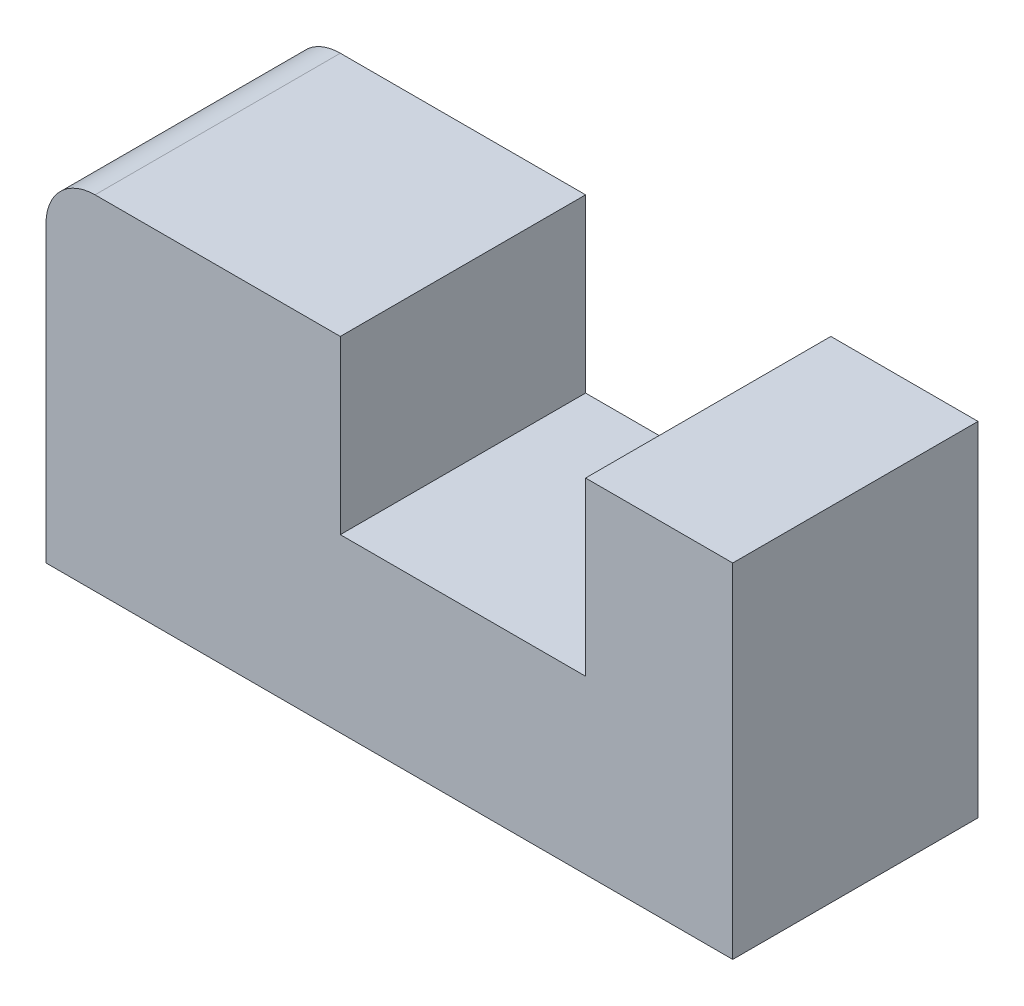
ISO-10303-21;
HEADER;
FILE_DESCRIPTION(('STEP AP214'),'2;1');
FILE_NAME('part.step','',(''),(''),'','','');
FILE_SCHEMA(('AUTOMOTIVE_DESIGN { 1 0 10303 214 1 1 1 1 }'));
ENDSEC;
DATA;
#1=APPLICATION_CONTEXT('core data for automotive mechanical design processes');
#2=APPLICATION_PROTOCOL_DEFINITION('international standard','automotive_design',2000,#1);
#3=PRODUCT_CONTEXT('',#1,'mechanical');
#4=PRODUCT('Part','Part','',(#3));
#5=PRODUCT_RELATED_PRODUCT_CATEGORY('part','',(#4));
#6=PRODUCT_DEFINITION_FORMATION('','',#4);
#7=PRODUCT_DEFINITION_CONTEXT('part definition',#1,'design');
#8=PRODUCT_DEFINITION('design','',#6,#7);
#9=PRODUCT_DEFINITION_SHAPE('','',#8);
#10=(LENGTH_UNIT() NAMED_UNIT(*) SI_UNIT(.MILLI.,.METRE.));
#11=(NAMED_UNIT(*) PLANE_ANGLE_UNIT() SI_UNIT($,.RADIAN.));
#12=(NAMED_UNIT(*) SI_UNIT($,.STERADIAN.) SOLID_ANGLE_UNIT());
#13=UNCERTAINTY_MEASURE_WITH_UNIT(LENGTH_MEASURE(1.E-05),#10,'distance_accuracy_value','');
#14=(GEOMETRIC_REPRESENTATION_CONTEXT(3) GLOBAL_UNCERTAINTY_ASSIGNED_CONTEXT((#13)) GLOBAL_UNIT_ASSIGNED_CONTEXT((#10,
#11,#12)) REPRESENTATION_CONTEXT('',''));
#15=CARTESIAN_POINT('',(0.,0.,0.));
#16=DIRECTION('',(0.,0.,1.));
#17=DIRECTION('',(1.,0.,0.));
#18=AXIS2_PLACEMENT_3D('',#15,#16,#17);
#19=CARTESIAN_POINT('',(-70.,-35.,50.));
#20=DIRECTION('',(1.,0.,0.));
#21=DIRECTION('',(0.,0.,-1.));
#22=AXIS2_PLACEMENT_3D('',#19,#20,#21);
#23=PLANE('',#22);
#24=DIRECTION('',(0.,-1.,0.));
#25=VECTOR('',#24,1.);
#26=CARTESIAN_POINT('',(-70.,-35.,50.));
#27=LINE('',#26,#25);
#28=CARTESIAN_POINT('',(-70.,25.,50.));
#29=VERTEX_POINT('',#28);
#30=CARTESIAN_POINT('',(-70.,-35.,50.));
#31=VERTEX_POINT('',#30);
#32=EDGE_CURVE('E105',#29,#31,#27,.T.);
#33=ORIENTED_EDGE('',*,*,#32,.F.);
#34=DIRECTION('',(0.,0.,-1.));
#35=VECTOR('',#34,1.);
#36=CARTESIAN_POINT('',(-70.,25.,50.));
#37=LINE('',#36,#35);
#38=CARTESIAN_POINT('',(-70.,25.,0.));
#39=VERTEX_POINT('',#38);
#40=EDGE_CURVE('E128',#29,#39,#37,.T.);
#41=ORIENTED_EDGE('',*,*,#40,.T.);
#42=DIRECTION('',(0.,-1.,0.));
#43=VECTOR('',#42,1.);
#44=CARTESIAN_POINT('',(-70.,-35.,0.));
#45=LINE('',#44,#43);
#46=CARTESIAN_POINT('',(-70.,-35.,0.));
#47=VERTEX_POINT('',#46);
#48=EDGE_CURVE('E126',#39,#47,#45,.T.);
#49=ORIENTED_EDGE('',*,*,#48,.T.);
#50=DIRECTION('',(0.,0.,-1.));
#51=VECTOR('',#50,1.);
#52=CARTESIAN_POINT('',(-70.,-35.,50.));
#53=LINE('',#52,#51);
#54=EDGE_CURVE('E120',#31,#47,#53,.T.);
#55=ORIENTED_EDGE('',*,*,#54,.F.);
#56=EDGE_LOOP('',(#33,#41,#49,#55));
#57=FACE_BOUND('',#56,.T.);
#58=ADVANCED_FACE('F35',(#57),#23,.F.);
#59=CARTESIAN_POINT('',(70.,-35.,50.));
#60=DIRECTION('',(0.,1.,0.));
#61=DIRECTION('',(-1.,0.,0.));
#62=AXIS2_PLACEMENT_3D('',#59,#60,#61);
#63=PLANE('',#62);
#64=DIRECTION('',(1.,0.,0.));
#65=VECTOR('',#64,1.);
#66=CARTESIAN_POINT('',(70.,-35.,0.));
#67=LINE('',#66,#65);
#68=CARTESIAN_POINT('',(70.,-35.,0.));
#69=VERTEX_POINT('',#68);
#70=EDGE_CURVE('E161',#47,#69,#67,.T.);
#71=ORIENTED_EDGE('',*,*,#70,.T.);
#72=DIRECTION('',(0.,0.,-1.));
#73=VECTOR('',#72,1.);
#74=CARTESIAN_POINT('',(70.,-35.,50.));
#75=LINE('',#74,#73);
#76=CARTESIAN_POINT('',(70.,-35.,50.));
#77=VERTEX_POINT('',#76);
#78=EDGE_CURVE('E122',#77,#69,#75,.T.);
#79=ORIENTED_EDGE('',*,*,#78,.F.);
#80=DIRECTION('',(1.,0.,0.));
#81=VECTOR('',#80,1.);
#82=CARTESIAN_POINT('',(70.,-35.,50.));
#83=LINE('',#82,#81);
#84=EDGE_CURVE('E108',#31,#77,#83,.T.);
#85=ORIENTED_EDGE('',*,*,#84,.F.);
#86=ORIENTED_EDGE('',*,*,#54,.T.);
#87=EDGE_LOOP('',(#71,#79,#85,#86));
#88=FACE_BOUND('',#87,.T.);
#89=ADVANCED_FACE('F119',(#88),#63,.F.);
#90=CARTESIAN_POINT('',(70.,-35.,50.));
#91=DIRECTION('',(-1.,0.,0.));
#92=DIRECTION('',(0.,0.,1.));
#93=AXIS2_PLACEMENT_3D('',#90,#91,#92);
#94=PLANE('',#93);
#95=DIRECTION('',(0.,1.,0.));
#96=VECTOR('',#95,1.);
#97=CARTESIAN_POINT('',(70.,-35.,0.));
#98=LINE('',#97,#96);
#99=CARTESIAN_POINT('',(70.,35.,0.));
#100=VERTEX_POINT('',#99);
#101=EDGE_CURVE('E159',#69,#100,#98,.T.);
#102=ORIENTED_EDGE('',*,*,#101,.T.);
#103=DIRECTION('',(0.,0.,-1.));
#104=VECTOR('',#103,1.);
#105=CARTESIAN_POINT('',(70.,35.,50.));
#106=LINE('',#105,#104);
#107=CARTESIAN_POINT('',(70.,35.,50.));
#108=VERTEX_POINT('',#107);
#109=EDGE_CURVE('E131',#108,#100,#106,.T.);
#110=ORIENTED_EDGE('',*,*,#109,.F.);
#111=DIRECTION('',(0.,1.,0.));
#112=VECTOR('',#111,1.);
#113=CARTESIAN_POINT('',(70.,-35.,50.));
#114=LINE('',#113,#112);
#115=EDGE_CURVE('E124',#77,#108,#114,.T.);
#116=ORIENTED_EDGE('',*,*,#115,.F.);
#117=ORIENTED_EDGE('',*,*,#78,.T.);
#118=EDGE_LOOP('',(#102,#110,#116,#117));
#119=FACE_BOUND('',#118,.T.);
#120=ADVANCED_FACE('F177',(#119),#94,.F.);
#121=CARTESIAN_POINT('',(70.,35.,50.));
#122=DIRECTION('',(0.,-1.,0.));
#123=DIRECTION('',(1.,0.,0.));
#124=AXIS2_PLACEMENT_3D('',#121,#122,#123);
#125=PLANE('',#124);
#126=DIRECTION('',(-1.,0.,0.));
#127=VECTOR('',#126,1.);
#128=CARTESIAN_POINT('',(70.,35.,0.));
#129=LINE('',#128,#127);
#130=CARTESIAN_POINT('',(40.,35.,0.));
#131=VERTEX_POINT('',#130);
#132=EDGE_CURVE('E157',#100,#131,#129,.T.);
#133=ORIENTED_EDGE('',*,*,#132,.T.);
#134=DIRECTION('',(0.,0.,-1.));
#135=VECTOR('',#134,1.);
#136=CARTESIAN_POINT('',(40.,35.,50.));
#137=LINE('',#136,#135);
#138=CARTESIAN_POINT('',(40.,35.,50.));
#139=VERTEX_POINT('',#138);
#140=EDGE_CURVE('E137',#139,#131,#137,.T.);
#141=ORIENTED_EDGE('',*,*,#140,.F.);
#142=DIRECTION('',(-1.,0.,0.));
#143=VECTOR('',#142,1.);
#144=CARTESIAN_POINT('',(70.,35.,50.));
#145=LINE('',#144,#143);
#146=EDGE_CURVE('E171',#108,#139,#145,.T.);
#147=ORIENTED_EDGE('',*,*,#146,.F.);
#148=ORIENTED_EDGE('',*,*,#109,.T.);
#149=EDGE_LOOP('',(#133,#141,#147,#148));
#150=FACE_BOUND('',#149,.T.);
#151=ADVANCED_FACE('F181',(#150),#125,.F.);
#152=CARTESIAN_POINT('',(40.,35.,50.));
#153=DIRECTION('',(1.,0.,0.));
#154=DIRECTION('',(0.,0.,-1.));
#155=AXIS2_PLACEMENT_3D('',#152,#153,#154);
#156=PLANE('',#155);
#157=DIRECTION('',(0.,-1.,0.));
#158=VECTOR('',#157,1.);
#159=CARTESIAN_POINT('',(40.,35.,0.));
#160=LINE('',#159,#158);
#161=CARTESIAN_POINT('',(40.,0.,0.));
#162=VERTEX_POINT('',#161);
#163=EDGE_CURVE('E155',#131,#162,#160,.T.);
#164=ORIENTED_EDGE('',*,*,#163,.T.);
#165=DIRECTION('',(0.,0.,-1.));
#166=VECTOR('',#165,1.);
#167=CARTESIAN_POINT('',(40.,0.,50.));
#168=LINE('',#167,#166);
#169=CARTESIAN_POINT('',(40.,0.,50.));
#170=VERTEX_POINT('',#169);
#171=EDGE_CURVE('E140',#170,#162,#168,.T.);
#172=ORIENTED_EDGE('',*,*,#171,.F.);
#173=DIRECTION('',(0.,-1.,0.));
#174=VECTOR('',#173,1.);
#175=CARTESIAN_POINT('',(40.,35.,50.));
#176=LINE('',#175,#174);
#177=EDGE_CURVE('E169',#139,#170,#176,.T.);
#178=ORIENTED_EDGE('',*,*,#177,.F.);
#179=ORIENTED_EDGE('',*,*,#140,.T.);
#180=EDGE_LOOP('',(#164,#172,#178,#179));
#181=FACE_BOUND('',#180,.T.);
#182=ADVANCED_FACE('F186',(#181),#156,.F.);
#183=CARTESIAN_POINT('',(40.,0.,50.));
#184=DIRECTION('',(0.,-1.,0.));
#185=DIRECTION('',(1.,0.,0.));
#186=AXIS2_PLACEMENT_3D('',#183,#184,#185);
#187=PLANE('',#186);
#188=DIRECTION('',(-1.,0.,0.));
#189=VECTOR('',#188,1.);
#190=CARTESIAN_POINT('',(40.,0.,0.));
#191=LINE('',#190,#189);
#192=CARTESIAN_POINT('',(-9.99999999999998,0.,0.));
#193=VERTEX_POINT('',#192);
#194=EDGE_CURVE('E153',#162,#193,#191,.T.);
#195=ORIENTED_EDGE('',*,*,#194,.T.);
#196=DIRECTION('',(0.,0.,-1.));
#197=VECTOR('',#196,1.);
#198=CARTESIAN_POINT('',(-9.99999999999998,0.,50.));
#199=LINE('',#198,#197);
#200=CARTESIAN_POINT('',(-9.99999999999998,0.,50.));
#201=VERTEX_POINT('',#200);
#202=EDGE_CURVE('E143',#201,#193,#199,.T.);
#203=ORIENTED_EDGE('',*,*,#202,.F.);
#204=DIRECTION('',(-1.,0.,0.));
#205=VECTOR('',#204,1.);
#206=CARTESIAN_POINT('',(40.,0.,50.));
#207=LINE('',#206,#205);
#208=EDGE_CURVE('E167',#170,#201,#207,.T.);
#209=ORIENTED_EDGE('',*,*,#208,.F.);
#210=ORIENTED_EDGE('',*,*,#171,.T.);
#211=EDGE_LOOP('',(#195,#203,#209,#210));
#212=FACE_BOUND('',#211,.T.);
#213=ADVANCED_FACE('F192',(#212),#187,.F.);
#214=CARTESIAN_POINT('',(-9.99999999999998,35.,50.));
#215=DIRECTION('',(-1.,0.,0.));
#216=DIRECTION('',(0.,-1.,0.));
#217=AXIS2_PLACEMENT_3D('',#214,#215,#216);
#218=PLANE('',#217);
#219=DIRECTION('',(0.,1.,0.));
#220=VECTOR('',#219,1.);
#221=CARTESIAN_POINT('',(-9.99999999999998,35.,0.));
#222=LINE('',#221,#220);
#223=CARTESIAN_POINT('',(-9.99999999999998,35.,0.));
#224=VERTEX_POINT('',#223);
#225=EDGE_CURVE('E151',#193,#224,#222,.T.);
#226=ORIENTED_EDGE('',*,*,#225,.T.);
#227=DIRECTION('',(0.,0.,-1.));
#228=VECTOR('',#227,1.);
#229=CARTESIAN_POINT('',(-9.99999999999998,35.,50.));
#230=LINE('',#229,#228);
#231=CARTESIAN_POINT('',(-9.99999999999998,35.,50.));
#232=VERTEX_POINT('',#231);
#233=EDGE_CURVE('E146',#232,#224,#230,.T.);
#234=ORIENTED_EDGE('',*,*,#233,.F.);
#235=DIRECTION('',(0.,1.,0.));
#236=VECTOR('',#235,1.);
#237=CARTESIAN_POINT('',(-9.99999999999998,35.,50.));
#238=LINE('',#237,#236);
#239=EDGE_CURVE('E165',#201,#232,#238,.T.);
#240=ORIENTED_EDGE('',*,*,#239,.F.);
#241=ORIENTED_EDGE('',*,*,#202,.T.);
#242=EDGE_LOOP('',(#226,#234,#240,#241));
#243=FACE_BOUND('',#242,.T.);
#244=ADVANCED_FACE('F196',(#243),#218,.F.);
#245=CARTESIAN_POINT('',(-9.99999999999998,35.,50.));
#246=DIRECTION('',(0.,-1.,0.));
#247=DIRECTION('',(0.,0.,-1.));
#248=AXIS2_PLACEMENT_3D('',#245,#246,#247);
#249=PLANE('',#248);
#250=DIRECTION('',(-1.,0.,0.));
#251=VECTOR('',#250,1.);
#252=CARTESIAN_POINT('',(-9.99999999999998,35.,0.));
#253=LINE('',#252,#251);
#254=CARTESIAN_POINT('',(-60.,35.,0.));
#255=VERTEX_POINT('',#254);
#256=EDGE_CURVE('E115',#224,#255,#253,.T.);
#257=ORIENTED_EDGE('',*,*,#256,.T.);
#258=DIRECTION('',(0.,0.,-1.));
#259=VECTOR('',#258,1.);
#260=CARTESIAN_POINT('',(-60.,35.,50.));
#261=LINE('',#260,#259);
#262=CARTESIAN_POINT('',(-60.,35.,50.));
#263=VERTEX_POINT('',#262);
#264=EDGE_CURVE('E43',#255,#263,#261,.F.);
#265=ORIENTED_EDGE('',*,*,#264,.T.);
#266=DIRECTION('',(-1.,0.,0.));
#267=VECTOR('',#266,1.);
#268=CARTESIAN_POINT('',(-9.99999999999998,35.,50.));
#269=LINE('',#268,#267);
#270=EDGE_CURVE('E149',#232,#263,#269,.T.);
#271=ORIENTED_EDGE('',*,*,#270,.F.);
#272=ORIENTED_EDGE('',*,*,#233,.T.);
#273=EDGE_LOOP('',(#257,#265,#271,#272));
#274=FACE_BOUND('',#273,.T.);
#275=ADVANCED_FACE('F197',(#274),#249,.F.);
#276=CARTESIAN_POINT('',(0.,0.,50.));
#277=DIRECTION('',(0.,0.,1.));
#278=DIRECTION('',(1.,0.,0.));
#279=AXIS2_PLACEMENT_3D('',#276,#277,#278);
#280=PLANE('',#279);
#281=ORIENTED_EDGE('',*,*,#270,.T.);
#282=CARTESIAN_POINT('',(-60.,25.,50.));
#283=DIRECTION('',(0.,0.,1.));
#284=DIRECTION('',(1.,0.,0.));
#285=AXIS2_PLACEMENT_3D('',#282,#283,#284);
#286=CIRCLE('',#285,10.);
#287=EDGE_CURVE('E11',#263,#29,#286,.T.);
#288=ORIENTED_EDGE('',*,*,#287,.T.);
#289=ORIENTED_EDGE('',*,*,#32,.T.);
#290=ORIENTED_EDGE('',*,*,#84,.T.);
#291=ORIENTED_EDGE('',*,*,#115,.T.);
#292=ORIENTED_EDGE('',*,*,#146,.T.);
#293=ORIENTED_EDGE('',*,*,#177,.T.);
#294=ORIENTED_EDGE('',*,*,#208,.T.);
#295=ORIENTED_EDGE('',*,*,#239,.T.);
#296=EDGE_LOOP('',(#281,#288,#289,#290,#291,#292,#293,#294,#295));
#297=FACE_BOUND('',#296,.T.);
#298=ADVANCED_FACE('F107',(#297),#280,.T.);
#299=CARTESIAN_POINT('',(0.,0.,0.));
#300=DIRECTION('',(0.,0.,1.));
#301=DIRECTION('',(1.,0.,0.));
#302=AXIS2_PLACEMENT_3D('',#299,#300,#301);
#303=PLANE('',#302);
#304=ORIENTED_EDGE('',*,*,#48,.F.);
#305=CARTESIAN_POINT('',(-60.,25.,0.));
#306=DIRECTION('',(0.,0.,1.));
#307=DIRECTION('',(1.,0.,0.));
#308=AXIS2_PLACEMENT_3D('',#305,#306,#307);
#309=CIRCLE('',#308,10.);
#310=EDGE_CURVE('E57',#39,#255,#309,.F.);
#311=ORIENTED_EDGE('',*,*,#310,.T.);
#312=ORIENTED_EDGE('',*,*,#256,.F.);
#313=ORIENTED_EDGE('',*,*,#225,.F.);
#314=ORIENTED_EDGE('',*,*,#194,.F.);
#315=ORIENTED_EDGE('',*,*,#163,.F.);
#316=ORIENTED_EDGE('',*,*,#132,.F.);
#317=ORIENTED_EDGE('',*,*,#101,.F.);
#318=ORIENTED_EDGE('',*,*,#70,.F.);
#319=EDGE_LOOP('',(#304,#311,#312,#313,#314,#315,#316,#317,#318));
#320=FACE_BOUND('',#319,.T.);
#321=ADVANCED_FACE('F199',(#320),#303,.F.);
#322=CARTESIAN_POINT('',(-60.,25.,50.));
#323=DIRECTION('',(0.,0.,-1.));
#324=DIRECTION('',(-1.,0.,0.));
#325=AXIS2_PLACEMENT_3D('',#322,#323,#324);
#326=CYLINDRICAL_SURFACE('',#325,10.);
#327=ORIENTED_EDGE('',*,*,#287,.F.);
#328=ORIENTED_EDGE('',*,*,#264,.F.);
#329=ORIENTED_EDGE('',*,*,#310,.F.);
#330=ORIENTED_EDGE('',*,*,#40,.F.);
#331=EDGE_LOOP('',(#327,#328,#329,#330));
#332=FACE_BOUND('',#331,.T.);
#333=ADVANCED_FACE('F37',(#332),#326,.T.);
#334=CLOSED_SHELL('',(#58,#89,#120,#151,#182,#213,#244,#275,#298,#321,#333));
#335=MANIFOLD_SOLID_BREP('B2',#334);
#336=ADVANCED_BREP_SHAPE_REPRESENTATION('',(#18,#335),#14);
#337=SHAPE_DEFINITION_REPRESENTATION(#9,#336);
ENDSEC;
END-ISO-10303-21;
